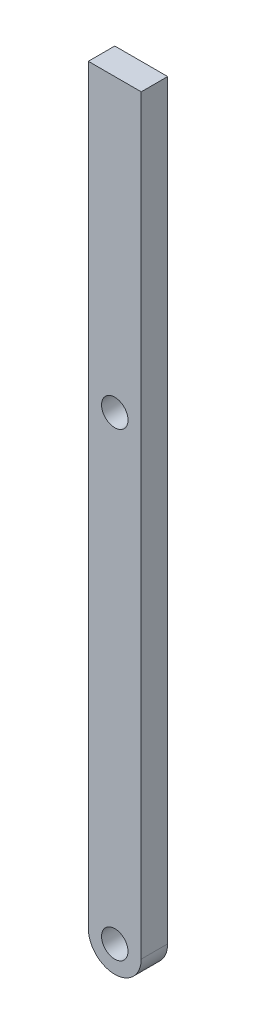
ISO-10303-21;
HEADER;
FILE_DESCRIPTION(('STEP AP214'),'2;1');
FILE_NAME('part.step','',(''),(''),'','','');
FILE_SCHEMA(('AUTOMOTIVE_DESIGN { 1 0 10303 214 1 1 1 1 }'));
ENDSEC;
DATA;
#1=APPLICATION_CONTEXT('core data for automotive mechanical design processes');
#2=APPLICATION_PROTOCOL_DEFINITION('international standard','automotive_design',2000,#1);
#3=PRODUCT_CONTEXT('',#1,'mechanical');
#4=PRODUCT('Part','Part','',(#3));
#5=PRODUCT_RELATED_PRODUCT_CATEGORY('part','',(#4));
#6=PRODUCT_DEFINITION_FORMATION('','',#4);
#7=PRODUCT_DEFINITION_CONTEXT('part definition',#1,'design');
#8=PRODUCT_DEFINITION('design','',#6,#7);
#9=PRODUCT_DEFINITION_SHAPE('','',#8);
#10=(LENGTH_UNIT() NAMED_UNIT(*) SI_UNIT(.MILLI.,.METRE.));
#11=(NAMED_UNIT(*) PLANE_ANGLE_UNIT() SI_UNIT($,.RADIAN.));
#12=(NAMED_UNIT(*) SI_UNIT($,.STERADIAN.) SOLID_ANGLE_UNIT());
#13=UNCERTAINTY_MEASURE_WITH_UNIT(LENGTH_MEASURE(1.E-05),#10,'distance_accuracy_value','');
#14=(GEOMETRIC_REPRESENTATION_CONTEXT(3) GLOBAL_UNCERTAINTY_ASSIGNED_CONTEXT((#13)) GLOBAL_UNIT_ASSIGNED_CONTEXT((#10,
#11,#12)) REPRESENTATION_CONTEXT('',''));
#15=CARTESIAN_POINT('',(0.,0.,0.));
#16=DIRECTION('',(0.,0.,1.));
#17=DIRECTION('',(1.,0.,0.));
#18=AXIS2_PLACEMENT_3D('',#15,#16,#17);
#19=CARTESIAN_POINT('',(0.,0.,6.35));
#20=DIRECTION('',(0.,0.,1.));
#21=DIRECTION('',(1.,0.,0.));
#22=AXIS2_PLACEMENT_3D('',#19,#20,#21);
#23=PLANE('',#22);
#24=CARTESIAN_POINT('',(-3.79008211886888E-13,110.49,6.35));
#25=DIRECTION('',(0.,0.,1.));
#26=DIRECTION('',(1.,0.,0.));
#27=AXIS2_PLACEMENT_3D('',#24,#25,#26);
#28=CIRCLE('',#27,3.175);
#29=CARTESIAN_POINT('',(3.17499999999962,110.49,6.35));
#30=VERTEX_POINT('',#29);
#31=EDGE_CURVE('E106',#30,#30,#28,.T.);
#32=ORIENTED_EDGE('',*,*,#31,.F.);
#33=EDGE_LOOP('',(#32));
#34=FACE_BOUND('',#33,.T.);
#35=DIRECTION('',(0.,1.,0.));
#36=VECTOR('',#35,1.);
#37=CARTESIAN_POINT('',(6.35,110.49,6.35));
#38=LINE('',#37,#36);
#39=CARTESIAN_POINT('',(6.35,0.,6.35));
#40=VERTEX_POINT('',#39);
#41=CARTESIAN_POINT('',(6.34999999999999,180.34,6.35));
#42=VERTEX_POINT('',#41);
#43=EDGE_CURVE('E57',#40,#42,#38,.T.);
#44=ORIENTED_EDGE('',*,*,#43,.T.);
#45=DIRECTION('',(-1.,0.,0.));
#46=VECTOR('',#45,1.);
#47=CARTESIAN_POINT('',(-6.34999999999999,180.34,6.35));
#48=LINE('',#47,#46);
#49=CARTESIAN_POINT('',(-6.34999999999999,180.34,6.35));
#50=VERTEX_POINT('',#49);
#51=EDGE_CURVE('E87',#42,#50,#48,.T.);
#52=ORIENTED_EDGE('',*,*,#51,.T.);
#53=DIRECTION('',(0.,-1.,0.));
#54=VECTOR('',#53,1.);
#55=CARTESIAN_POINT('',(-6.35,110.49,6.35));
#56=LINE('',#55,#54);
#57=CARTESIAN_POINT('',(-6.35,0.,6.35));
#58=VERTEX_POINT('',#57);
#59=EDGE_CURVE('E91',#50,#58,#56,.T.);
#60=ORIENTED_EDGE('',*,*,#59,.T.);
#61=CARTESIAN_POINT('',(0.,0.,6.35));
#62=DIRECTION('',(0.,0.,1.));
#63=DIRECTION('',(1.,0.,0.));
#64=AXIS2_PLACEMENT_3D('',#61,#62,#63);
#65=CIRCLE('',#64,6.35);
#66=EDGE_CURVE('E99',#58,#40,#65,.T.);
#67=ORIENTED_EDGE('',*,*,#66,.T.);
#68=EDGE_LOOP('',(#44,#52,#60,#67));
#69=FACE_BOUND('',#68,.T.);
#70=CARTESIAN_POINT('',(0.,0.,6.35));
#71=DIRECTION('',(0.,0.,1.));
#72=DIRECTION('',(1.,0.,0.));
#73=AXIS2_PLACEMENT_3D('',#70,#71,#72);
#74=CIRCLE('',#73,3.175);
#75=CARTESIAN_POINT('',(3.175,0.,6.35));
#76=VERTEX_POINT('',#75);
#77=EDGE_CURVE('E145',#76,#76,#74,.T.);
#78=ORIENTED_EDGE('',*,*,#77,.F.);
#79=EDGE_LOOP('',(#78));
#80=FACE_BOUND('',#79,.T.);
#81=ADVANCED_FACE('F40',(#34,#69,#80),#23,.T.);
#82=CARTESIAN_POINT('',(0.,0.,0.));
#83=DIRECTION('',(0.,0.,1.));
#84=DIRECTION('',(1.,0.,0.));
#85=AXIS2_PLACEMENT_3D('',#82,#83,#84);
#86=PLANE('',#85);
#87=DIRECTION('',(-1.,0.,0.));
#88=VECTOR('',#87,1.);
#89=CARTESIAN_POINT('',(-6.34999999999999,180.34,0.));
#90=LINE('',#89,#88);
#91=CARTESIAN_POINT('',(6.34999999999999,180.34,0.));
#92=VERTEX_POINT('',#91);
#93=CARTESIAN_POINT('',(-6.34999999999999,180.34,0.));
#94=VERTEX_POINT('',#93);
#95=EDGE_CURVE('E95',#92,#94,#90,.T.);
#96=ORIENTED_EDGE('',*,*,#95,.F.);
#97=DIRECTION('',(0.,1.,0.));
#98=VECTOR('',#97,1.);
#99=CARTESIAN_POINT('',(6.35,110.49,0.));
#100=LINE('',#99,#98);
#101=CARTESIAN_POINT('',(6.35,0.,0.));
#102=VERTEX_POINT('',#101);
#103=EDGE_CURVE('E109',#102,#92,#100,.T.);
#104=ORIENTED_EDGE('',*,*,#103,.F.);
#105=CARTESIAN_POINT('',(0.,0.,0.));
#106=DIRECTION('',(0.,0.,1.));
#107=DIRECTION('',(1.,0.,0.));
#108=AXIS2_PLACEMENT_3D('',#105,#106,#107);
#109=CIRCLE('',#108,6.35);
#110=CARTESIAN_POINT('',(-6.35,0.,0.));
#111=VERTEX_POINT('',#110);
#112=EDGE_CURVE('E81',#111,#102,#109,.T.);
#113=ORIENTED_EDGE('',*,*,#112,.F.);
#114=DIRECTION('',(0.,-1.,0.));
#115=VECTOR('',#114,1.);
#116=CARTESIAN_POINT('',(-6.35,110.49,0.));
#117=LINE('',#116,#115);
#118=EDGE_CURVE('E74',#94,#111,#117,.T.);
#119=ORIENTED_EDGE('',*,*,#118,.F.);
#120=EDGE_LOOP('',(#96,#104,#113,#119));
#121=FACE_BOUND('',#120,.T.);
#122=CARTESIAN_POINT('',(-3.79008211886888E-13,110.49,0.));
#123=DIRECTION('',(0.,0.,1.));
#124=DIRECTION('',(1.,0.,0.));
#125=AXIS2_PLACEMENT_3D('',#122,#123,#124);
#126=CIRCLE('',#125,3.175);
#127=CARTESIAN_POINT('',(3.17499999999962,110.49,0.));
#128=VERTEX_POINT('',#127);
#129=EDGE_CURVE('E151',#128,#128,#126,.T.);
#130=ORIENTED_EDGE('',*,*,#129,.T.);
#131=EDGE_LOOP('',(#130));
#132=FACE_BOUND('',#131,.T.);
#133=CARTESIAN_POINT('',(0.,0.,0.));
#134=DIRECTION('',(0.,0.,1.));
#135=DIRECTION('',(1.,0.,0.));
#136=AXIS2_PLACEMENT_3D('',#133,#134,#135);
#137=CIRCLE('',#136,3.175);
#138=CARTESIAN_POINT('',(3.175,0.,0.));
#139=VERTEX_POINT('',#138);
#140=EDGE_CURVE('E148',#139,#139,#137,.T.);
#141=ORIENTED_EDGE('',*,*,#140,.T.);
#142=EDGE_LOOP('',(#141));
#143=FACE_BOUND('',#142,.T.);
#144=ADVANCED_FACE('F115',(#121,#132,#143),#86,.F.);
#145=CARTESIAN_POINT('',(-6.34999999999999,180.34,6.35));
#146=DIRECTION('',(0.,-1.,0.));
#147=DIRECTION('',(0.,0.,-1.));
#148=AXIS2_PLACEMENT_3D('',#145,#146,#147);
#149=PLANE('',#148);
#150=ORIENTED_EDGE('',*,*,#95,.T.);
#151=DIRECTION('',(0.,0.,-1.));
#152=VECTOR('',#151,1.);
#153=CARTESIAN_POINT('',(-6.34999999999999,180.34,6.35));
#154=LINE('',#153,#152);
#155=EDGE_CURVE('E49',#50,#94,#154,.T.);
#156=ORIENTED_EDGE('',*,*,#155,.F.);
#157=ORIENTED_EDGE('',*,*,#51,.F.);
#158=DIRECTION('',(0.,0.,-1.));
#159=VECTOR('',#158,1.);
#160=CARTESIAN_POINT('',(6.34999999999999,180.34,6.35));
#161=LINE('',#160,#159);
#162=EDGE_CURVE('E11',#42,#92,#161,.T.);
#163=ORIENTED_EDGE('',*,*,#162,.T.);
#164=EDGE_LOOP('',(#150,#156,#157,#163));
#165=FACE_BOUND('',#164,.T.);
#166=ADVANCED_FACE('F42',(#165),#149,.F.);
#167=CARTESIAN_POINT('',(-6.35,110.49,6.35));
#168=DIRECTION('',(1.,0.,0.));
#169=DIRECTION('',(0.,0.,-1.));
#170=AXIS2_PLACEMENT_3D('',#167,#168,#169);
#171=PLANE('',#170);
#172=ORIENTED_EDGE('',*,*,#118,.T.);
#173=DIRECTION('',(0.,0.,-1.));
#174=VECTOR('',#173,1.);
#175=CARTESIAN_POINT('',(-6.35,0.,6.35));
#176=LINE('',#175,#174);
#177=EDGE_CURVE('E96',#58,#111,#176,.T.);
#178=ORIENTED_EDGE('',*,*,#177,.F.);
#179=ORIENTED_EDGE('',*,*,#59,.F.);
#180=ORIENTED_EDGE('',*,*,#155,.T.);
#181=EDGE_LOOP('',(#172,#178,#179,#180));
#182=FACE_BOUND('',#181,.T.);
#183=ADVANCED_FACE('F97',(#182),#171,.F.);
#184=CARTESIAN_POINT('',(0.,0.,6.35));
#185=DIRECTION('',(0.,0.,-1.));
#186=DIRECTION('',(-1.,0.,0.));
#187=AXIS2_PLACEMENT_3D('',#184,#185,#186);
#188=CYLINDRICAL_SURFACE('',#187,6.35);
#189=ORIENTED_EDGE('',*,*,#112,.T.);
#190=DIRECTION('',(0.,0.,-1.));
#191=VECTOR('',#190,1.);
#192=CARTESIAN_POINT('',(6.35,0.,6.35));
#193=LINE('',#192,#191);
#194=EDGE_CURVE('E101',#40,#102,#193,.T.);
#195=ORIENTED_EDGE('',*,*,#194,.F.);
#196=ORIENTED_EDGE('',*,*,#66,.F.);
#197=ORIENTED_EDGE('',*,*,#177,.T.);
#198=EDGE_LOOP('',(#189,#195,#196,#197));
#199=FACE_BOUND('',#198,.T.);
#200=ADVANCED_FACE('F112',(#199),#188,.T.);
#201=CARTESIAN_POINT('',(6.35,110.49,6.35));
#202=DIRECTION('',(-1.,0.,0.));
#203=DIRECTION('',(0.,0.,1.));
#204=AXIS2_PLACEMENT_3D('',#201,#202,#203);
#205=PLANE('',#204);
#206=ORIENTED_EDGE('',*,*,#103,.T.);
#207=ORIENTED_EDGE('',*,*,#162,.F.);
#208=ORIENTED_EDGE('',*,*,#43,.F.);
#209=ORIENTED_EDGE('',*,*,#194,.T.);
#210=EDGE_LOOP('',(#206,#207,#208,#209));
#211=FACE_BOUND('',#210,.T.);
#212=ADVANCED_FACE('F117',(#211),#205,.F.);
#213=CARTESIAN_POINT('',(-3.79008211886888E-13,110.49,6.35));
#214=DIRECTION('',(0.,0.,-1.));
#215=DIRECTION('',(-1.,0.,0.));
#216=AXIS2_PLACEMENT_3D('',#213,#214,#215);
#217=CYLINDRICAL_SURFACE('',#216,3.175);
#218=ORIENTED_EDGE('',*,*,#31,.T.);
#219=EDGE_LOOP('',(#218));
#220=FACE_BOUND('',#219,.T.);
#221=ORIENTED_EDGE('',*,*,#129,.F.);
#222=EDGE_LOOP('',(#221));
#223=FACE_BOUND('',#222,.T.);
#224=ADVANCED_FACE('F119',(#220,#223),#217,.F.);
#225=CARTESIAN_POINT('',(0.,0.,6.35));
#226=DIRECTION('',(0.,0.,-1.));
#227=DIRECTION('',(-1.,0.,0.));
#228=AXIS2_PLACEMENT_3D('',#225,#226,#227);
#229=CYLINDRICAL_SURFACE('',#228,3.175);
#230=ORIENTED_EDGE('',*,*,#77,.T.);
#231=EDGE_LOOP('',(#230));
#232=FACE_BOUND('',#231,.T.);
#233=ORIENTED_EDGE('',*,*,#140,.F.);
#234=EDGE_LOOP('',(#233));
#235=FACE_BOUND('',#234,.T.);
#236=ADVANCED_FACE('F125',(#232,#235),#229,.F.);
#237=CLOSED_SHELL('',(#81,#144,#166,#183,#200,#212,#224,#236));
#238=MANIFOLD_SOLID_BREP('B2',#237);
#239=ADVANCED_BREP_SHAPE_REPRESENTATION('',(#18,#238),#14);
#240=SHAPE_DEFINITION_REPRESENTATION(#9,#239);
ENDSEC;
END-ISO-10303-21;
